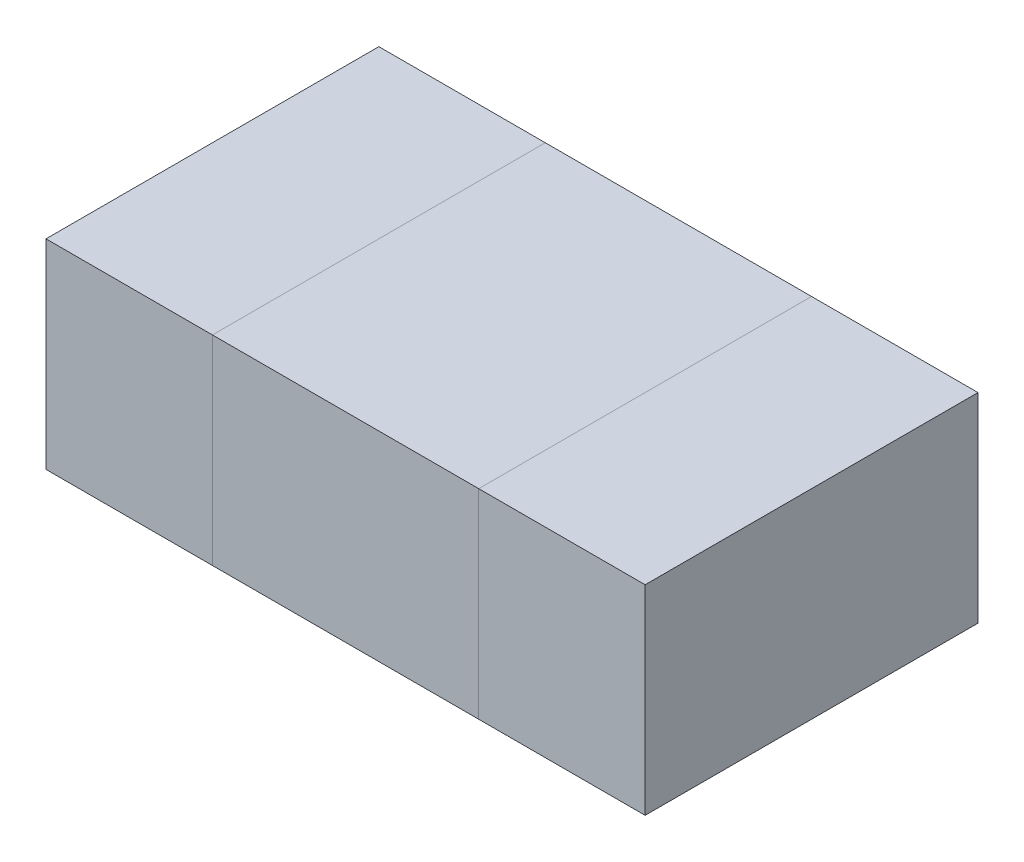
ISO-10303-21;
HEADER;
FILE_DESCRIPTION(('STEP AP214'),'2;1');
FILE_NAME('part.step','',(''),(''),'','','');
FILE_SCHEMA(('AUTOMOTIVE_DESIGN { 1 0 10303 214 1 1 1 1 }'));
ENDSEC;
DATA;
#1=APPLICATION_CONTEXT('core data for automotive mechanical design processes');
#2=APPLICATION_PROTOCOL_DEFINITION('international standard','automotive_design',2000,#1);
#3=PRODUCT_CONTEXT('',#1,'mechanical');
#4=PRODUCT('Part','Part','',(#3));
#5=PRODUCT_RELATED_PRODUCT_CATEGORY('part','',(#4));
#6=PRODUCT_DEFINITION_FORMATION('','',#4);
#7=PRODUCT_DEFINITION_CONTEXT('part definition',#1,'design');
#8=PRODUCT_DEFINITION('design','',#6,#7);
#9=PRODUCT_DEFINITION_SHAPE('','',#8);
#10=(LENGTH_UNIT() NAMED_UNIT(*) SI_UNIT(.MILLI.,.METRE.));
#11=(NAMED_UNIT(*) PLANE_ANGLE_UNIT() SI_UNIT($,.RADIAN.));
#12=(NAMED_UNIT(*) SI_UNIT($,.STERADIAN.) SOLID_ANGLE_UNIT());
#13=UNCERTAINTY_MEASURE_WITH_UNIT(LENGTH_MEASURE(1.E-05),#10,'distance_accuracy_value','');
#14=(GEOMETRIC_REPRESENTATION_CONTEXT(3) GLOBAL_UNCERTAINTY_ASSIGNED_CONTEXT((#13)) GLOBAL_UNIT_ASSIGNED_CONTEXT((#10,
#11,#12)) REPRESENTATION_CONTEXT('',''));
#15=CARTESIAN_POINT('',(0.,0.,0.));
#16=DIRECTION('',(0.,0.,1.));
#17=DIRECTION('',(1.,0.,0.));
#18=AXIS2_PLACEMENT_3D('',#15,#16,#17);
#19=CARTESIAN_POINT('',(0.2,0.3,-0.25));
#20=DIRECTION('',(1.,0.,0.));
#21=DIRECTION('',(0.,0.,-1.));
#22=AXIS2_PLACEMENT_3D('',#19,#20,#21);
#23=PLANE('',#22);
#24=DIRECTION('',(0.,0.,1.));
#25=VECTOR('',#24,1.);
#26=CARTESIAN_POINT('',(0.2,0.,-0.25));
#27=LINE('',#26,#25);
#28=CARTESIAN_POINT('',(0.2,0.,-0.25));
#29=VERTEX_POINT('',#28);
#30=CARTESIAN_POINT('',(0.2,0.,0.25));
#31=VERTEX_POINT('',#30);
#32=EDGE_CURVE('E116',#29,#31,#27,.T.);
#33=ORIENTED_EDGE('',*,*,#32,.T.);
#34=DIRECTION('',(0.,-1.,0.));
#35=VECTOR('',#34,1.);
#36=CARTESIAN_POINT('',(0.2,0.3,0.25));
#37=LINE('',#36,#35);
#38=CARTESIAN_POINT('',(0.2,0.3,0.25));
#39=VERTEX_POINT('',#38);
#40=EDGE_CURVE('E12',#39,#31,#37,.T.);
#41=ORIENTED_EDGE('',*,*,#40,.F.);
#42=DIRECTION('',(0.,0.,1.));
#43=VECTOR('',#42,1.);
#44=CARTESIAN_POINT('',(0.2,0.3,-0.25));
#45=LINE('',#44,#43);
#46=CARTESIAN_POINT('',(0.2,0.3,-0.25));
#47=VERTEX_POINT('',#46);
#48=EDGE_CURVE('E99',#47,#39,#45,.T.);
#49=ORIENTED_EDGE('',*,*,#48,.F.);
#50=DIRECTION('',(0.,-1.,0.));
#51=VECTOR('',#50,1.);
#52=CARTESIAN_POINT('',(0.2,0.3,-0.25));
#53=LINE('',#52,#51);
#54=EDGE_CURVE('E112',#47,#29,#53,.T.);
#55=ORIENTED_EDGE('',*,*,#54,.T.);
#56=EDGE_LOOP('',(#33,#41,#49,#55));
#57=FACE_BOUND('',#56,.T.);
#58=ADVANCED_FACE('F47',(#57),#23,.F.);
#59=CARTESIAN_POINT('',(0.2,0.3,0.25));
#60=DIRECTION('',(0.,0.,-1.));
#61=DIRECTION('',(-1.,0.,0.));
#62=AXIS2_PLACEMENT_3D('',#59,#60,#61);
#63=PLANE('',#62);
#64=DIRECTION('',(1.,0.,0.));
#65=VECTOR('',#64,1.);
#66=CARTESIAN_POINT('',(0.2,0.,0.25));
#67=LINE('',#66,#65);
#68=CARTESIAN_POINT('',(0.45,0.,0.25));
#69=VERTEX_POINT('',#68);
#70=EDGE_CURVE('E104',#31,#69,#67,.T.);
#71=ORIENTED_EDGE('',*,*,#70,.T.);
#72=DIRECTION('',(0.,-1.,0.));
#73=VECTOR('',#72,1.);
#74=CARTESIAN_POINT('',(0.45,0.3,0.25));
#75=LINE('',#74,#73);
#76=CARTESIAN_POINT('',(0.45,0.3,0.25));
#77=VERTEX_POINT('',#76);
#78=EDGE_CURVE('E56',#77,#69,#75,.T.);
#79=ORIENTED_EDGE('',*,*,#78,.F.);
#80=DIRECTION('',(1.,0.,0.));
#81=VECTOR('',#80,1.);
#82=CARTESIAN_POINT('',(0.2,0.3,0.25));
#83=LINE('',#82,#81);
#84=EDGE_CURVE('E94',#39,#77,#83,.T.);
#85=ORIENTED_EDGE('',*,*,#84,.F.);
#86=ORIENTED_EDGE('',*,*,#40,.T.);
#87=EDGE_LOOP('',(#71,#79,#85,#86));
#88=FACE_BOUND('',#87,.T.);
#89=ADVANCED_FACE('F103',(#88),#63,.F.);
#90=CARTESIAN_POINT('',(0.45,0.3,-0.25));
#91=DIRECTION('',(-1.,0.,0.));
#92=DIRECTION('',(0.,0.,1.));
#93=AXIS2_PLACEMENT_3D('',#90,#91,#92);
#94=PLANE('',#93);
#95=DIRECTION('',(0.,0.,-1.));
#96=VECTOR('',#95,1.);
#97=CARTESIAN_POINT('',(0.45,0.,-0.25));
#98=LINE('',#97,#96);
#99=CARTESIAN_POINT('',(0.45,0.,-0.25));
#100=VERTEX_POINT('',#99);
#101=EDGE_CURVE('E81',#69,#100,#98,.T.);
#102=ORIENTED_EDGE('',*,*,#101,.T.);
#103=DIRECTION('',(0.,-1.,0.));
#104=VECTOR('',#103,1.);
#105=CARTESIAN_POINT('',(0.45,0.3,-0.25));
#106=LINE('',#105,#104);
#107=CARTESIAN_POINT('',(0.45,0.3,-0.25));
#108=VERTEX_POINT('',#107);
#109=EDGE_CURVE('E106',#108,#100,#106,.T.);
#110=ORIENTED_EDGE('',*,*,#109,.F.);
#111=DIRECTION('',(0.,0.,-1.));
#112=VECTOR('',#111,1.);
#113=CARTESIAN_POINT('',(0.45,0.3,-0.25));
#114=LINE('',#113,#112);
#115=EDGE_CURVE('E97',#77,#108,#114,.T.);
#116=ORIENTED_EDGE('',*,*,#115,.F.);
#117=ORIENTED_EDGE('',*,*,#78,.T.);
#118=EDGE_LOOP('',(#102,#110,#116,#117));
#119=FACE_BOUND('',#118,.T.);
#120=ADVANCED_FACE('F107',(#119),#94,.F.);
#121=CARTESIAN_POINT('',(0.2,0.3,-0.25));
#122=DIRECTION('',(0.,0.,1.));
#123=DIRECTION('',(1.,0.,0.));
#124=AXIS2_PLACEMENT_3D('',#121,#122,#123);
#125=PLANE('',#124);
#126=DIRECTION('',(-1.,0.,0.));
#127=VECTOR('',#126,1.);
#128=CARTESIAN_POINT('',(0.2,0.,-0.25));
#129=LINE('',#128,#127);
#130=EDGE_CURVE('E87',#100,#29,#129,.T.);
#131=ORIENTED_EDGE('',*,*,#130,.T.);
#132=ORIENTED_EDGE('',*,*,#54,.F.);
#133=DIRECTION('',(-1.,0.,0.));
#134=VECTOR('',#133,1.);
#135=CARTESIAN_POINT('',(0.2,0.3,-0.25));
#136=LINE('',#135,#134);
#137=EDGE_CURVE('E64',#108,#47,#136,.T.);
#138=ORIENTED_EDGE('',*,*,#137,.F.);
#139=ORIENTED_EDGE('',*,*,#109,.T.);
#140=EDGE_LOOP('',(#131,#132,#138,#139));
#141=FACE_BOUND('',#140,.T.);
#142=ADVANCED_FACE('F129',(#141),#125,.F.);
#143=CARTESIAN_POINT('',(0.,0.3,0.));
#144=DIRECTION('',(0.,1.,0.));
#145=DIRECTION('',(0.,0.,1.));
#146=AXIS2_PLACEMENT_3D('',#143,#144,#145);
#147=PLANE('',#146);
#148=ORIENTED_EDGE('',*,*,#48,.T.);
#149=ORIENTED_EDGE('',*,*,#84,.T.);
#150=ORIENTED_EDGE('',*,*,#115,.T.);
#151=ORIENTED_EDGE('',*,*,#137,.T.);
#152=EDGE_LOOP('',(#148,#149,#150,#151));
#153=FACE_BOUND('',#152,.T.);
#154=ADVANCED_FACE('F95',(#153),#147,.T.);
#155=CARTESIAN_POINT('',(0.,0.,0.));
#156=DIRECTION('',(0.,1.,0.));
#157=DIRECTION('',(0.,0.,1.));
#158=AXIS2_PLACEMENT_3D('',#155,#156,#157);
#159=PLANE('',#158);
#160=ORIENTED_EDGE('',*,*,#32,.F.);
#161=ORIENTED_EDGE('',*,*,#130,.F.);
#162=ORIENTED_EDGE('',*,*,#101,.F.);
#163=ORIENTED_EDGE('',*,*,#70,.F.);
#164=EDGE_LOOP('',(#160,#161,#162,#163));
#165=FACE_BOUND('',#164,.T.);
#166=ADVANCED_FACE('F132',(#165),#159,.F.);
#167=CLOSED_SHELL('',(#58,#89,#120,#142,#154,#166));
#168=MANIFOLD_SOLID_BREP('B2',#167);
#169=CARTESIAN_POINT('',(-0.2,0.3,-0.25));
#170=DIRECTION('',(-1.,0.,0.));
#171=DIRECTION('',(0.,0.,1.));
#172=AXIS2_PLACEMENT_3D('',#169,#170,#171);
#173=PLANE('',#172);
#174=DIRECTION('',(0.,0.,-1.));
#175=VECTOR('',#174,1.);
#176=CARTESIAN_POINT('',(-0.2,0.,-0.25));
#177=LINE('',#176,#175);
#178=CARTESIAN_POINT('',(-0.2,0.,0.25));
#179=VERTEX_POINT('',#178);
#180=CARTESIAN_POINT('',(-0.2,0.,-0.25));
#181=VERTEX_POINT('',#180);
#182=EDGE_CURVE('E266',#179,#181,#177,.T.);
#183=ORIENTED_EDGE('',*,*,#182,.T.);
#184=DIRECTION('',(0.,-1.,0.));
#185=VECTOR('',#184,1.);
#186=CARTESIAN_POINT('',(-0.2,0.3,-0.25));
#187=LINE('',#186,#185);
#188=CARTESIAN_POINT('',(-0.2,0.3,-0.25));
#189=VERTEX_POINT('',#188);
#190=EDGE_CURVE('E45',#189,#181,#187,.T.);
#191=ORIENTED_EDGE('',*,*,#190,.F.);
#192=DIRECTION('',(0.,0.,-1.));
#193=VECTOR('',#192,1.);
#194=CARTESIAN_POINT('',(-0.2,0.3,-0.25));
#195=LINE('',#194,#193);
#196=CARTESIAN_POINT('',(-0.2,0.3,0.25));
#197=VERTEX_POINT('',#196);
#198=EDGE_CURVE('E249',#197,#189,#195,.T.);
#199=ORIENTED_EDGE('',*,*,#198,.F.);
#200=DIRECTION('',(0.,-1.,0.));
#201=VECTOR('',#200,1.);
#202=CARTESIAN_POINT('',(-0.2,0.3,0.25));
#203=LINE('',#202,#201);
#204=EDGE_CURVE('E262',#197,#179,#203,.T.);
#205=ORIENTED_EDGE('',*,*,#204,.T.);
#206=EDGE_LOOP('',(#183,#191,#199,#205));
#207=FACE_BOUND('',#206,.T.);
#208=ADVANCED_FACE('F197',(#207),#173,.F.);
#209=CARTESIAN_POINT('',(-0.2,0.3,-0.25));
#210=DIRECTION('',(0.,0.,1.));
#211=DIRECTION('',(1.,0.,0.));
#212=AXIS2_PLACEMENT_3D('',#209,#210,#211);
#213=PLANE('',#212);
#214=DIRECTION('',(-1.,0.,0.));
#215=VECTOR('',#214,1.);
#216=CARTESIAN_POINT('',(-0.2,0.,-0.25));
#217=LINE('',#216,#215);
#218=CARTESIAN_POINT('',(-0.45,0.,-0.25));
#219=VERTEX_POINT('',#218);
#220=EDGE_CURVE('E254',#181,#219,#217,.T.);
#221=ORIENTED_EDGE('',*,*,#220,.T.);
#222=DIRECTION('',(0.,-1.,0.));
#223=VECTOR('',#222,1.);
#224=CARTESIAN_POINT('',(-0.45,0.3,-0.25));
#225=LINE('',#224,#223);
#226=CARTESIAN_POINT('',(-0.45,0.3,-0.25));
#227=VERTEX_POINT('',#226);
#228=EDGE_CURVE('E206',#227,#219,#225,.T.);
#229=ORIENTED_EDGE('',*,*,#228,.F.);
#230=DIRECTION('',(-1.,0.,0.));
#231=VECTOR('',#230,1.);
#232=CARTESIAN_POINT('',(-0.2,0.3,-0.25));
#233=LINE('',#232,#231);
#234=EDGE_CURVE('E244',#189,#227,#233,.T.);
#235=ORIENTED_EDGE('',*,*,#234,.F.);
#236=ORIENTED_EDGE('',*,*,#190,.T.);
#237=EDGE_LOOP('',(#221,#229,#235,#236));
#238=FACE_BOUND('',#237,.T.);
#239=ADVANCED_FACE('F253',(#238),#213,.F.);
#240=CARTESIAN_POINT('',(-0.45,0.3,-0.25));
#241=DIRECTION('',(1.,0.,0.));
#242=DIRECTION('',(0.,0.,-1.));
#243=AXIS2_PLACEMENT_3D('',#240,#241,#242);
#244=PLANE('',#243);
#245=DIRECTION('',(0.,0.,1.));
#246=VECTOR('',#245,1.);
#247=CARTESIAN_POINT('',(-0.45,0.,-0.25));
#248=LINE('',#247,#246);
#249=CARTESIAN_POINT('',(-0.45,0.,0.25));
#250=VERTEX_POINT('',#249);
#251=EDGE_CURVE('E231',#219,#250,#248,.T.);
#252=ORIENTED_EDGE('',*,*,#251,.T.);
#253=DIRECTION('',(0.,-1.,0.));
#254=VECTOR('',#253,1.);
#255=CARTESIAN_POINT('',(-0.45,0.3,0.25));
#256=LINE('',#255,#254);
#257=CARTESIAN_POINT('',(-0.45,0.3,0.25));
#258=VERTEX_POINT('',#257);
#259=EDGE_CURVE('E256',#258,#250,#256,.T.);
#260=ORIENTED_EDGE('',*,*,#259,.F.);
#261=DIRECTION('',(0.,0.,1.));
#262=VECTOR('',#261,1.);
#263=CARTESIAN_POINT('',(-0.45,0.3,-0.25));
#264=LINE('',#263,#262);
#265=EDGE_CURVE('E247',#227,#258,#264,.T.);
#266=ORIENTED_EDGE('',*,*,#265,.F.);
#267=ORIENTED_EDGE('',*,*,#228,.T.);
#268=EDGE_LOOP('',(#252,#260,#266,#267));
#269=FACE_BOUND('',#268,.T.);
#270=ADVANCED_FACE('F257',(#269),#244,.F.);
#271=CARTESIAN_POINT('',(-0.2,0.3,0.25));
#272=DIRECTION('',(0.,0.,-1.));
#273=DIRECTION('',(-1.,0.,0.));
#274=AXIS2_PLACEMENT_3D('',#271,#272,#273);
#275=PLANE('',#274);
#276=DIRECTION('',(1.,0.,0.));
#277=VECTOR('',#276,1.);
#278=CARTESIAN_POINT('',(-0.2,0.,0.25));
#279=LINE('',#278,#277);
#280=EDGE_CURVE('E237',#250,#179,#279,.T.);
#281=ORIENTED_EDGE('',*,*,#280,.T.);
#282=ORIENTED_EDGE('',*,*,#204,.F.);
#283=DIRECTION('',(1.,0.,0.));
#284=VECTOR('',#283,1.);
#285=CARTESIAN_POINT('',(-0.2,0.3,0.25));
#286=LINE('',#285,#284);
#287=EDGE_CURVE('E214',#258,#197,#286,.T.);
#288=ORIENTED_EDGE('',*,*,#287,.F.);
#289=ORIENTED_EDGE('',*,*,#259,.T.);
#290=EDGE_LOOP('',(#281,#282,#288,#289));
#291=FACE_BOUND('',#290,.T.);
#292=ADVANCED_FACE('F279',(#291),#275,.F.);
#293=CARTESIAN_POINT('',(0.,0.3,0.));
#294=DIRECTION('',(0.,-1.,0.));
#295=DIRECTION('',(0.,0.,-1.));
#296=AXIS2_PLACEMENT_3D('',#293,#294,#295);
#297=PLANE('',#296);
#298=ORIENTED_EDGE('',*,*,#198,.T.);
#299=ORIENTED_EDGE('',*,*,#234,.T.);
#300=ORIENTED_EDGE('',*,*,#265,.T.);
#301=ORIENTED_EDGE('',*,*,#287,.T.);
#302=EDGE_LOOP('',(#298,#299,#300,#301));
#303=FACE_BOUND('',#302,.T.);
#304=ADVANCED_FACE('F245',(#303),#297,.F.);
#305=CARTESIAN_POINT('',(0.,0.,0.));
#306=DIRECTION('',(0.,-1.,0.));
#307=DIRECTION('',(0.,0.,-1.));
#308=AXIS2_PLACEMENT_3D('',#305,#306,#307);
#309=PLANE('',#308);
#310=ORIENTED_EDGE('',*,*,#182,.F.);
#311=ORIENTED_EDGE('',*,*,#280,.F.);
#312=ORIENTED_EDGE('',*,*,#251,.F.);
#313=ORIENTED_EDGE('',*,*,#220,.F.);
#314=EDGE_LOOP('',(#310,#311,#312,#313));
#315=FACE_BOUND('',#314,.T.);
#316=ADVANCED_FACE('F282',(#315),#309,.T.);
#317=CLOSED_SHELL('',(#208,#239,#270,#292,#304,#316));
#318=MANIFOLD_SOLID_BREP('B6',#317);
#319=CARTESIAN_POINT('',(0.2,0.3,0.25));
#320=DIRECTION('',(-1.,0.,0.));
#321=DIRECTION('',(0.,0.,1.));
#322=AXIS2_PLACEMENT_3D('',#319,#320,#321);
#323=PLANE('',#322);
#324=DIRECTION('',(0.,0.,-1.));
#325=VECTOR('',#324,1.);
#326=CARTESIAN_POINT('',(0.2,0.,0.25));
#327=LINE('',#326,#325);
#328=CARTESIAN_POINT('',(0.2,0.,0.25));
#329=VERTEX_POINT('',#328);
#330=CARTESIAN_POINT('',(0.2,0.,-0.25));
#331=VERTEX_POINT('',#330);
#332=EDGE_CURVE('E406',#329,#331,#327,.T.);
#333=ORIENTED_EDGE('',*,*,#332,.T.);
#334=DIRECTION('',(0.,-1.,0.));
#335=VECTOR('',#334,1.);
#336=CARTESIAN_POINT('',(0.2,0.3,-0.25));
#337=LINE('',#336,#335);
#338=CARTESIAN_POINT('',(0.2,0.3,-0.25));
#339=VERTEX_POINT('',#338);
#340=EDGE_CURVE('E195',#339,#331,#337,.T.);
#341=ORIENTED_EDGE('',*,*,#340,.F.);
#342=DIRECTION('',(0.,0.,-1.));
#343=VECTOR('',#342,1.);
#344=CARTESIAN_POINT('',(0.2,0.3,0.25));
#345=LINE('',#344,#343);
#346=CARTESIAN_POINT('',(0.2,0.3,0.25));
#347=VERTEX_POINT('',#346);
#348=EDGE_CURVE('E390',#347,#339,#345,.T.);
#349=ORIENTED_EDGE('',*,*,#348,.F.);
#350=DIRECTION('',(0.,-1.,0.));
#351=VECTOR('',#350,1.);
#352=CARTESIAN_POINT('',(0.2,0.3,0.25));
#353=LINE('',#352,#351);
#354=EDGE_CURVE('E402',#347,#329,#353,.T.);
#355=ORIENTED_EDGE('',*,*,#354,.T.);
#356=EDGE_LOOP('',(#333,#341,#349,#355));
#357=FACE_BOUND('',#356,.T.);
#358=ADVANCED_FACE('F338',(#357),#323,.F.);
#359=CARTESIAN_POINT('',(-0.2,0.3,-0.25));
#360=DIRECTION('',(0.,0.,1.));
#361=DIRECTION('',(1.,0.,0.));
#362=AXIS2_PLACEMENT_3D('',#359,#360,#361);
#363=PLANE('',#362);
#364=DIRECTION('',(-1.,0.,0.));
#365=VECTOR('',#364,1.);
#366=CARTESIAN_POINT('',(-0.2,0.,-0.25));
#367=LINE('',#366,#365);
#368=CARTESIAN_POINT('',(-0.2,0.,-0.25));
#369=VERTEX_POINT('',#368);
#370=EDGE_CURVE('E395',#331,#369,#367,.T.);
#371=ORIENTED_EDGE('',*,*,#370,.T.);
#372=DIRECTION('',(0.,-1.,0.));
#373=VECTOR('',#372,1.);
#374=CARTESIAN_POINT('',(-0.2,0.3,-0.25));
#375=LINE('',#374,#373);
#376=CARTESIAN_POINT('',(-0.2,0.3,-0.25));
#377=VERTEX_POINT('',#376);
#378=EDGE_CURVE('E347',#377,#369,#375,.T.);
#379=ORIENTED_EDGE('',*,*,#378,.F.);
#380=DIRECTION('',(-1.,0.,0.));
#381=VECTOR('',#380,1.);
#382=CARTESIAN_POINT('',(-0.2,0.3,-0.25));
#383=LINE('',#382,#381);
#384=EDGE_CURVE('E385',#339,#377,#383,.T.);
#385=ORIENTED_EDGE('',*,*,#384,.F.);
#386=ORIENTED_EDGE('',*,*,#340,.T.);
#387=EDGE_LOOP('',(#371,#379,#385,#386));
#388=FACE_BOUND('',#387,.T.);
#389=ADVANCED_FACE('F394',(#388),#363,.F.);
#390=CARTESIAN_POINT('',(-0.2,0.3,0.25));
#391=DIRECTION('',(1.,0.,0.));
#392=DIRECTION('',(0.,0.,-1.));
#393=AXIS2_PLACEMENT_3D('',#390,#391,#392);
#394=PLANE('',#393);
#395=DIRECTION('',(0.,0.,1.));
#396=VECTOR('',#395,1.);
#397=CARTESIAN_POINT('',(-0.2,0.,0.25));
#398=LINE('',#397,#396);
#399=CARTESIAN_POINT('',(-0.2,0.,0.25));
#400=VERTEX_POINT('',#399);
#401=EDGE_CURVE('E372',#369,#400,#398,.T.);
#402=ORIENTED_EDGE('',*,*,#401,.T.);
#403=DIRECTION('',(0.,-1.,0.));
#404=VECTOR('',#403,1.);
#405=CARTESIAN_POINT('',(-0.2,0.3,0.25));
#406=LINE('',#405,#404);
#407=CARTESIAN_POINT('',(-0.2,0.3,0.25));
#408=VERTEX_POINT('',#407);
#409=EDGE_CURVE('E397',#408,#400,#406,.T.);
#410=ORIENTED_EDGE('',*,*,#409,.F.);
#411=DIRECTION('',(0.,0.,1.));
#412=VECTOR('',#411,1.);
#413=CARTESIAN_POINT('',(-0.2,0.3,0.25));
#414=LINE('',#413,#412);
#415=EDGE_CURVE('E388',#377,#408,#414,.T.);
#416=ORIENTED_EDGE('',*,*,#415,.F.);
#417=ORIENTED_EDGE('',*,*,#378,.T.);
#418=EDGE_LOOP('',(#402,#410,#416,#417));
#419=FACE_BOUND('',#418,.T.);
#420=ADVANCED_FACE('F398',(#419),#394,.F.);
#421=CARTESIAN_POINT('',(-0.2,0.3,0.25));
#422=DIRECTION('',(0.,0.,-1.));
#423=DIRECTION('',(-1.,0.,0.));
#424=AXIS2_PLACEMENT_3D('',#421,#422,#423);
#425=PLANE('',#424);
#426=DIRECTION('',(1.,0.,0.));
#427=VECTOR('',#426,1.);
#428=CARTESIAN_POINT('',(-0.2,0.,0.25));
#429=LINE('',#428,#427);
#430=EDGE_CURVE('E378',#400,#329,#429,.T.);
#431=ORIENTED_EDGE('',*,*,#430,.T.);
#432=ORIENTED_EDGE('',*,*,#354,.F.);
#433=DIRECTION('',(1.,0.,0.));
#434=VECTOR('',#433,1.);
#435=CARTESIAN_POINT('',(-0.2,0.3,0.25));
#436=LINE('',#435,#434);
#437=EDGE_CURVE('E355',#408,#347,#436,.T.);
#438=ORIENTED_EDGE('',*,*,#437,.F.);
#439=ORIENTED_EDGE('',*,*,#409,.T.);
#440=EDGE_LOOP('',(#431,#432,#438,#439));
#441=FACE_BOUND('',#440,.T.);
#442=ADVANCED_FACE('F419',(#441),#425,.F.);
#443=CARTESIAN_POINT('',(0.,0.3,0.));
#444=DIRECTION('',(0.,-1.,0.));
#445=DIRECTION('',(0.,0.,-1.));
#446=AXIS2_PLACEMENT_3D('',#443,#444,#445);
#447=PLANE('',#446);
#448=ORIENTED_EDGE('',*,*,#348,.T.);
#449=ORIENTED_EDGE('',*,*,#384,.T.);
#450=ORIENTED_EDGE('',*,*,#415,.T.);
#451=ORIENTED_EDGE('',*,*,#437,.T.);
#452=EDGE_LOOP('',(#448,#449,#450,#451));
#453=FACE_BOUND('',#452,.T.);
#454=ADVANCED_FACE('F386',(#453),#447,.F.);
#455=CARTESIAN_POINT('',(0.,0.,0.));
#456=DIRECTION('',(0.,-1.,0.));
#457=DIRECTION('',(0.,0.,-1.));
#458=AXIS2_PLACEMENT_3D('',#455,#456,#457);
#459=PLANE('',#458);
#460=ORIENTED_EDGE('',*,*,#332,.F.);
#461=ORIENTED_EDGE('',*,*,#430,.F.);
#462=ORIENTED_EDGE('',*,*,#401,.F.);
#463=ORIENTED_EDGE('',*,*,#370,.F.);
#464=EDGE_LOOP('',(#460,#461,#462,#463));
#465=FACE_BOUND('',#464,.T.);
#466=ADVANCED_FACE('F422',(#465),#459,.T.);
#467=CLOSED_SHELL('',(#358,#389,#420,#442,#454,#466));
#468=MANIFOLD_SOLID_BREP('B39',#467);
#469=ADVANCED_BREP_SHAPE_REPRESENTATION('',(#18,#168,#318,#468),#14);
#470=SHAPE_DEFINITION_REPRESENTATION(#9,#469);
ENDSEC;
END-ISO-10303-21;
